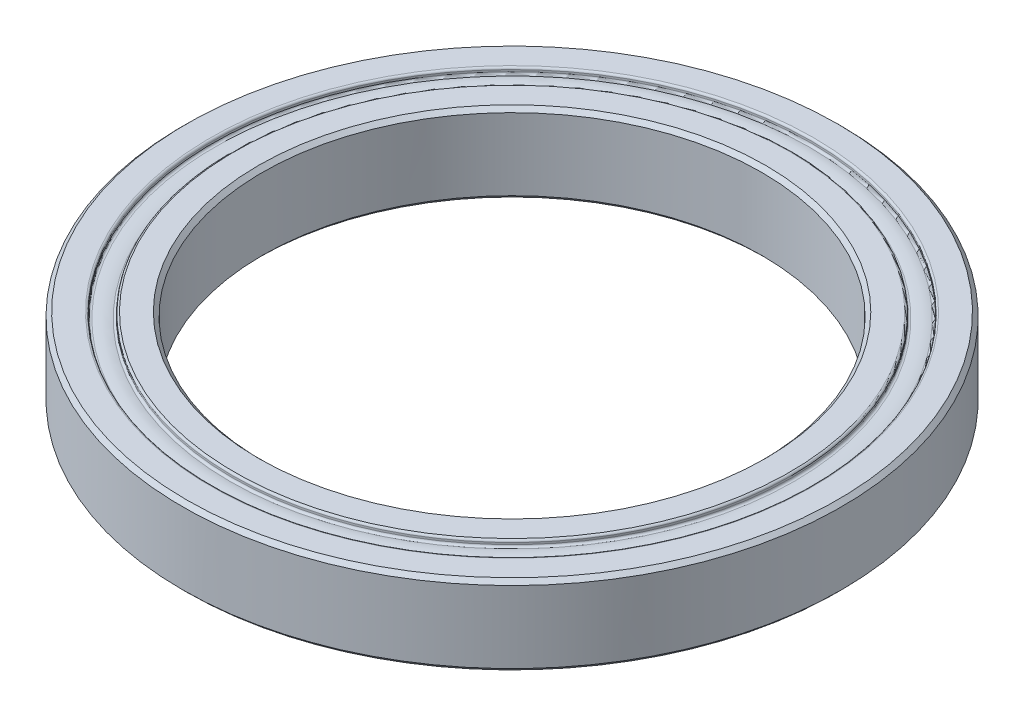
ISO-10303-21;
HEADER;
FILE_DESCRIPTION(('STEP AP214'),'2;1');
FILE_NAME('part.step','',(''),(''),'','','');
FILE_SCHEMA(('AUTOMOTIVE_DESIGN { 1 0 10303 214 1 1 1 1 }'));
ENDSEC;
DATA;
#1=APPLICATION_CONTEXT('core data for automotive mechanical design processes');
#2=APPLICATION_PROTOCOL_DEFINITION('international standard','automotive_design',2000,#1);
#3=PRODUCT_CONTEXT('',#1,'mechanical');
#4=PRODUCT('Part','Part','',(#3));
#5=PRODUCT_RELATED_PRODUCT_CATEGORY('part','',(#4));
#6=PRODUCT_DEFINITION_FORMATION('','',#4);
#7=PRODUCT_DEFINITION_CONTEXT('part definition',#1,'design');
#8=PRODUCT_DEFINITION('design','',#6,#7);
#9=PRODUCT_DEFINITION_SHAPE('','',#8);
#10=(LENGTH_UNIT() NAMED_UNIT(*) SI_UNIT(.MILLI.,.METRE.));
#11=(NAMED_UNIT(*) PLANE_ANGLE_UNIT() SI_UNIT($,.RADIAN.));
#12=(NAMED_UNIT(*) SI_UNIT($,.STERADIAN.) SOLID_ANGLE_UNIT());
#13=UNCERTAINTY_MEASURE_WITH_UNIT(LENGTH_MEASURE(1.E-05),#10,'distance_accuracy_value','');
#14=(GEOMETRIC_REPRESENTATION_CONTEXT(3) GLOBAL_UNCERTAINTY_ASSIGNED_CONTEXT((#13)) GLOBAL_UNIT_ASSIGNED_CONTEXT((#10,
#11,#12)) REPRESENTATION_CONTEXT('',''));
#15=CARTESIAN_POINT('',(0.,0.,0.));
#16=DIRECTION('',(0.,0.,1.));
#17=DIRECTION('',(1.,0.,0.));
#18=AXIS2_PLACEMENT_3D('',#15,#16,#17);
#19=CARTESIAN_POINT('',(-27.8,8.,0.));
#20=DIRECTION('',(0.,-1.,0.));
#21=DIRECTION('',(0.,0.,-1.));
#22=AXIS2_PLACEMENT_3D('',#19,#20,#21);
#23=PLANE('',#22);
#24=CARTESIAN_POINT('',(0.,8.,0.));
#25=DIRECTION('',(0.,-1.,0.));
#26=DIRECTION('',(0.,0.,-1.));
#27=AXIS2_PLACEMENT_3D('',#24,#25,#26);
#28=CIRCLE('',#27,25.4);
#29=CARTESIAN_POINT('',(0.,8.,-25.4));
#30=VERTEX_POINT('',#29);
#31=EDGE_CURVE('E52',#30,#30,#28,.T.);
#32=ORIENTED_EDGE('',*,*,#31,.T.);
#33=EDGE_LOOP('',(#32));
#34=FACE_BOUND('',#33,.T.);
#35=CARTESIAN_POINT('',(0.,8.00000000000001,0.));
#36=DIRECTION('',(0.,-1.,0.));
#37=DIRECTION('',(0.,0.,-1.));
#38=AXIS2_PLACEMENT_3D('',#35,#36,#37);
#39=CIRCLE('',#38,27.8);
#40=CARTESIAN_POINT('',(0.,8.00000000000001,-27.8));
#41=VERTEX_POINT('',#40);
#42=EDGE_CURVE('E109',#41,#41,#39,.T.);
#43=ORIENTED_EDGE('',*,*,#42,.F.);
#44=EDGE_LOOP('',(#43));
#45=FACE_BOUND('',#44,.T.);
#46=ADVANCED_FACE('F32',(#34,#45),#23,.F.);
#47=CARTESIAN_POINT('',(0.,0.,0.));
#48=DIRECTION('',(0.,-1.,0.));
#49=DIRECTION('',(0.,0.,-1.));
#50=AXIS2_PLACEMENT_3D('',#47,#48,#49);
#51=CYLINDRICAL_SURFACE('',#50,25.);
#52=CARTESIAN_POINT('',(0.,7.60000000000001,0.));
#53=DIRECTION('',(0.,-1.,0.));
#54=DIRECTION('',(0.,0.,-1.));
#55=AXIS2_PLACEMENT_3D('',#52,#53,#54);
#56=CIRCLE('',#55,25.);
#57=CARTESIAN_POINT('',(0.,7.60000000000001,-25.));
#58=VERTEX_POINT('',#57);
#59=EDGE_CURVE('E43',#58,#58,#56,.F.);
#60=ORIENTED_EDGE('',*,*,#59,.T.);
#61=EDGE_LOOP('',(#60));
#62=FACE_BOUND('',#61,.T.);
#63=CARTESIAN_POINT('',(0.,0.399999999999978,0.));
#64=DIRECTION('',(0.,1.,0.));
#65=DIRECTION('',(0.,0.,1.));
#66=AXIS2_PLACEMENT_3D('',#63,#64,#65);
#67=CIRCLE('',#66,25.);
#68=CARTESIAN_POINT('',(0.,0.399999999999978,25.));
#69=VERTEX_POINT('',#68);
#70=EDGE_CURVE('E47',#69,#69,#67,.F.);
#71=ORIENTED_EDGE('',*,*,#70,.T.);
#72=EDGE_LOOP('',(#71));
#73=FACE_BOUND('',#72,.T.);
#74=ADVANCED_FACE('F116',(#62,#73),#51,.F.);
#75=CARTESIAN_POINT('',(-25.,0.,0.));
#76=DIRECTION('',(0.,1.,0.));
#77=DIRECTION('',(0.,0.,1.));
#78=AXIS2_PLACEMENT_3D('',#75,#76,#77);
#79=PLANE('',#78);
#80=CARTESIAN_POINT('',(0.,0.,0.));
#81=DIRECTION('',(0.,1.,0.));
#82=DIRECTION('',(0.,0.,1.));
#83=AXIS2_PLACEMENT_3D('',#80,#81,#82);
#84=CIRCLE('',#83,25.4);
#85=CARTESIAN_POINT('',(0.,0.,25.4));
#86=VERTEX_POINT('',#85);
#87=EDGE_CURVE('E39',#86,#86,#84,.T.);
#88=ORIENTED_EDGE('',*,*,#87,.T.);
#89=EDGE_LOOP('',(#88));
#90=FACE_BOUND('',#89,.T.);
#91=CARTESIAN_POINT('',(0.,0.,0.));
#92=DIRECTION('',(0.,-1.,0.));
#93=DIRECTION('',(0.,0.,-1.));
#94=AXIS2_PLACEMENT_3D('',#91,#92,#93);
#95=CIRCLE('',#94,27.8);
#96=CARTESIAN_POINT('',(0.,0.,-27.8));
#97=VERTEX_POINT('',#96);
#98=EDGE_CURVE('E64',#97,#97,#95,.T.);
#99=ORIENTED_EDGE('',*,*,#98,.T.);
#100=EDGE_LOOP('',(#99));
#101=FACE_BOUND('',#100,.T.);
#102=ADVANCED_FACE('F122',(#90,#101),#79,.F.);
#103=CARTESIAN_POINT('',(0.,0.2,0.));
#104=DIRECTION('',(0.,-1.,0.));
#105=DIRECTION('',(0.,0.,-1.));
#106=AXIS2_PLACEMENT_3D('',#103,#104,#105);
#107=TOROIDAL_SURFACE('',#106,27.8,0.2);
#108=ORIENTED_EDGE('',*,*,#98,.F.);
#109=EDGE_LOOP('',(#108));
#110=FACE_BOUND('',#109,.T.);
#111=CARTESIAN_POINT('',(0.,0.2,0.));
#112=DIRECTION('',(0.,-1.,0.));
#113=DIRECTION('',(0.,0.,-1.));
#114=AXIS2_PLACEMENT_3D('',#111,#112,#113);
#115=CIRCLE('',#114,28.);
#116=CARTESIAN_POINT('',(0.,0.2,-28.));
#117=VERTEX_POINT('',#116);
#118=EDGE_CURVE('E67',#117,#117,#115,.T.);
#119=ORIENTED_EDGE('',*,*,#118,.T.);
#120=EDGE_LOOP('',(#119));
#121=FACE_BOUND('',#120,.T.);
#122=ADVANCED_FACE('F188',(#110,#121),#107,.T.);
#123=CARTESIAN_POINT('',(0.,0.,0.));
#124=DIRECTION('',(0.,-1.,0.));
#125=DIRECTION('',(0.,0.,-1.));
#126=AXIS2_PLACEMENT_3D('',#123,#124,#125);
#127=CYLINDRICAL_SURFACE('',#126,28.);
#128=ORIENTED_EDGE('',*,*,#118,.F.);
#129=EDGE_LOOP('',(#128));
#130=FACE_BOUND('',#129,.T.);
#131=CARTESIAN_POINT('',(0.,0.387521626362308,0.));
#132=DIRECTION('',(0.,-1.,0.));
#133=DIRECTION('',(0.,0.,-1.));
#134=AXIS2_PLACEMENT_3D('',#131,#132,#133);
#135=CIRCLE('',#134,28.);
#136=CARTESIAN_POINT('',(0.,0.387521626362308,-28.));
#137=VERTEX_POINT('',#136);
#138=EDGE_CURVE('E70',#137,#137,#135,.T.);
#139=ORIENTED_EDGE('',*,*,#138,.T.);
#140=EDGE_LOOP('',(#139));
#141=FACE_BOUND('',#140,.T.);
#142=ADVANCED_FACE('F184',(#130,#141),#127,.T.);
#143=CARTESIAN_POINT('',(0.,0.387521626362308,0.));
#144=DIRECTION('',(0.,-1.,0.));
#145=DIRECTION('',(0.,0.,-1.));
#146=AXIS2_PLACEMENT_3D('',#143,#144,#145);
#147=TOROIDAL_SURFACE('',#146,28.2,0.200000000000001);
#148=ORIENTED_EDGE('',*,*,#138,.F.);
#149=EDGE_LOOP('',(#148));
#150=FACE_BOUND('',#149,.T.);
#151=CARTESIAN_POINT('',(0.,0.582790727640021,0.));
#152=DIRECTION('',(0.,-1.,0.));
#153=DIRECTION('',(0.,0.,-1.));
#154=AXIS2_PLACEMENT_3D('',#151,#152,#153);
#155=CIRCLE('',#154,28.2432432432433);
#156=CARTESIAN_POINT('',(0.,0.582790727640021,-28.2432432432433));
#157=VERTEX_POINT('',#156);
#158=EDGE_CURVE('E73',#157,#157,#155,.T.);
#159=ORIENTED_EDGE('',*,*,#158,.T.);
#160=EDGE_LOOP('',(#159));
#161=FACE_BOUND('',#160,.T.);
#162=ADVANCED_FACE('F180',(#150,#161),#147,.F.);
#163=CARTESIAN_POINT('',(0.,4.,0.));
#164=DIRECTION('',(0.,-1.,0.));
#165=DIRECTION('',(0.,0.,-1.));
#166=AXIS2_PLACEMENT_3D('',#163,#164,#165);
#167=TOROIDAL_SURFACE('',#166,29.,3.5);
#168=ORIENTED_EDGE('',*,*,#158,.F.);
#169=EDGE_LOOP('',(#168));
#170=FACE_BOUND('',#169,.T.);
#171=CARTESIAN_POINT('',(0.,0.582790727640023,0.));
#172=DIRECTION('',(0.,-1.,0.));
#173=DIRECTION('',(0.,0.,-1.));
#174=AXIS2_PLACEMENT_3D('',#171,#172,#173);
#175=CIRCLE('',#174,29.7567567567568);
#176=CARTESIAN_POINT('',(0.,0.582790727640023,-29.7567567567568));
#177=VERTEX_POINT('',#176);
#178=EDGE_CURVE('E76',#177,#177,#175,.T.);
#179=ORIENTED_EDGE('',*,*,#178,.T.);
#180=EDGE_LOOP('',(#179));
#181=FACE_BOUND('',#180,.T.);
#182=ADVANCED_FACE('F176',(#170,#181),#167,.T.);
#183=CARTESIAN_POINT('',(0.,0.387521626362311,0.));
#184=DIRECTION('',(0.,-1.,0.));
#185=DIRECTION('',(0.,0.,-1.));
#186=AXIS2_PLACEMENT_3D('',#183,#184,#185);
#187=TOROIDAL_SURFACE('',#186,29.8,0.199999999999996);
#188=ORIENTED_EDGE('',*,*,#178,.F.);
#189=EDGE_LOOP('',(#188));
#190=FACE_BOUND('',#189,.T.);
#191=CARTESIAN_POINT('',(0.,0.387521626362311,0.));
#192=DIRECTION('',(0.,-1.,0.));
#193=DIRECTION('',(0.,0.,-1.));
#194=AXIS2_PLACEMENT_3D('',#191,#192,#193);
#195=CIRCLE('',#194,30.);
#196=CARTESIAN_POINT('',(0.,0.387521626362311,-30.));
#197=VERTEX_POINT('',#196);
#198=EDGE_CURVE('E79',#197,#197,#195,.T.);
#199=ORIENTED_EDGE('',*,*,#198,.T.);
#200=EDGE_LOOP('',(#199));
#201=FACE_BOUND('',#200,.T.);
#202=ADVANCED_FACE('F172',(#190,#201),#187,.F.);
#203=CARTESIAN_POINT('',(0.,0.,0.));
#204=DIRECTION('',(0.,-1.,0.));
#205=DIRECTION('',(0.,0.,-1.));
#206=AXIS2_PLACEMENT_3D('',#203,#204,#205);
#207=CYLINDRICAL_SURFACE('',#206,30.);
#208=ORIENTED_EDGE('',*,*,#198,.F.);
#209=EDGE_LOOP('',(#208));
#210=FACE_BOUND('',#209,.T.);
#211=CARTESIAN_POINT('',(0.,0.199999999999999,0.));
#212=DIRECTION('',(0.,-1.,0.));
#213=DIRECTION('',(0.,0.,-1.));
#214=AXIS2_PLACEMENT_3D('',#211,#212,#213);
#215=CIRCLE('',#214,30.);
#216=CARTESIAN_POINT('',(0.,0.199999999999999,-30.));
#217=VERTEX_POINT('',#216);
#218=EDGE_CURVE('E82',#217,#217,#215,.T.);
#219=ORIENTED_EDGE('',*,*,#218,.T.);
#220=EDGE_LOOP('',(#219));
#221=FACE_BOUND('',#220,.T.);
#222=ADVANCED_FACE('F168',(#210,#221),#207,.F.);
#223=CARTESIAN_POINT('',(0.,0.199999999999999,0.));
#224=DIRECTION('',(0.,-1.,0.));
#225=DIRECTION('',(0.,0.,-1.));
#226=AXIS2_PLACEMENT_3D('',#223,#224,#225);
#227=TOROIDAL_SURFACE('',#226,30.2,0.2);
#228=ORIENTED_EDGE('',*,*,#218,.F.);
#229=EDGE_LOOP('',(#228));
#230=FACE_BOUND('',#229,.T.);
#231=CARTESIAN_POINT('',(0.,0.,0.));
#232=DIRECTION('',(0.,-1.,0.));
#233=DIRECTION('',(0.,0.,-1.));
#234=AXIS2_PLACEMENT_3D('',#231,#232,#233);
#235=CIRCLE('',#234,30.2);
#236=CARTESIAN_POINT('',(0.,0.,-30.2));
#237=VERTEX_POINT('',#236);
#238=EDGE_CURVE('E85',#237,#237,#235,.T.);
#239=ORIENTED_EDGE('',*,*,#238,.T.);
#240=EDGE_LOOP('',(#239));
#241=FACE_BOUND('',#240,.T.);
#242=ADVANCED_FACE('F162',(#230,#241),#227,.T.);
#243=CARTESIAN_POINT('',(-30.2,0.,0.));
#244=DIRECTION('',(0.,1.,0.));
#245=DIRECTION('',(0.,0.,1.));
#246=AXIS2_PLACEMENT_3D('',#243,#244,#245);
#247=PLANE('',#246);
#248=CARTESIAN_POINT('',(0.,0.,0.));
#249=DIRECTION('',(0.,1.,0.));
#250=DIRECTION('',(0.,0.,1.));
#251=AXIS2_PLACEMENT_3D('',#248,#249,#250);
#252=CIRCLE('',#251,32.6);
#253=CARTESIAN_POINT('',(0.,0.,32.6));
#254=VERTEX_POINT('',#253);
#255=EDGE_CURVE('E10',#254,#254,#252,.F.);
#256=ORIENTED_EDGE('',*,*,#255,.T.);
#257=EDGE_LOOP('',(#256));
#258=FACE_BOUND('',#257,.T.);
#259=ORIENTED_EDGE('',*,*,#238,.F.);
#260=EDGE_LOOP('',(#259));
#261=FACE_BOUND('',#260,.T.);
#262=ADVANCED_FACE('F152',(#258,#261),#247,.F.);
#263=CARTESIAN_POINT('',(0.,0.,0.));
#264=DIRECTION('',(0.,-1.,0.));
#265=DIRECTION('',(0.,0.,-1.));
#266=AXIS2_PLACEMENT_3D('',#263,#264,#265);
#267=CYLINDRICAL_SURFACE('',#266,33.);
#268=CARTESIAN_POINT('',(0.,7.60000000000001,0.));
#269=DIRECTION('',(0.,-1.,0.));
#270=DIRECTION('',(0.,0.,-1.));
#271=AXIS2_PLACEMENT_3D('',#268,#269,#270);
#272=CIRCLE('',#271,33.);
#273=CARTESIAN_POINT('',(0.,7.60000000000001,-33.));
#274=VERTEX_POINT('',#273);
#275=EDGE_CURVE('E58',#274,#274,#272,.T.);
#276=ORIENTED_EDGE('',*,*,#275,.T.);
#277=EDGE_LOOP('',(#276));
#278=FACE_BOUND('',#277,.T.);
#279=CARTESIAN_POINT('',(0.,0.400000000000015,0.));
#280=DIRECTION('',(0.,1.,0.));
#281=DIRECTION('',(0.,0.,1.));
#282=AXIS2_PLACEMENT_3D('',#279,#280,#281);
#283=CIRCLE('',#282,33.);
#284=CARTESIAN_POINT('',(0.,0.400000000000015,33.));
#285=VERTEX_POINT('',#284);
#286=EDGE_CURVE('E61',#285,#285,#283,.T.);
#287=ORIENTED_EDGE('',*,*,#286,.T.);
#288=EDGE_LOOP('',(#287));
#289=FACE_BOUND('',#288,.T.);
#290=ADVANCED_FACE('F149',(#278,#289),#267,.T.);
#291=CARTESIAN_POINT('',(-33.,8.00000000000001,0.));
#292=DIRECTION('',(0.,-1.,0.));
#293=DIRECTION('',(0.,0.,-1.));
#294=AXIS2_PLACEMENT_3D('',#291,#292,#293);
#295=PLANE('',#294);
#296=CARTESIAN_POINT('',(0.,8.00000000000001,0.));
#297=DIRECTION('',(0.,-1.,0.));
#298=DIRECTION('',(0.,0.,-1.));
#299=AXIS2_PLACEMENT_3D('',#296,#297,#298);
#300=CIRCLE('',#299,32.6);
#301=CARTESIAN_POINT('',(0.,8.00000000000001,-32.6));
#302=VERTEX_POINT('',#301);
#303=EDGE_CURVE('E55',#302,#302,#300,.F.);
#304=ORIENTED_EDGE('',*,*,#303,.T.);
#305=EDGE_LOOP('',(#304));
#306=FACE_BOUND('',#305,.T.);
#307=CARTESIAN_POINT('',(0.,8.00000000000001,0.));
#308=DIRECTION('',(0.,-1.,0.));
#309=DIRECTION('',(0.,0.,-1.));
#310=AXIS2_PLACEMENT_3D('',#307,#308,#309);
#311=CIRCLE('',#310,30.2);
#312=CARTESIAN_POINT('',(0.,8.00000000000001,-30.2));
#313=VERTEX_POINT('',#312);
#314=EDGE_CURVE('E88',#313,#313,#311,.T.);
#315=ORIENTED_EDGE('',*,*,#314,.T.);
#316=EDGE_LOOP('',(#315));
#317=FACE_BOUND('',#316,.T.);
#318=ADVANCED_FACE('F151',(#306,#317),#295,.F.);
#319=CARTESIAN_POINT('',(0.,7.80000000000001,0.));
#320=DIRECTION('',(0.,-1.,0.));
#321=DIRECTION('',(0.,0.,-1.));
#322=AXIS2_PLACEMENT_3D('',#319,#320,#321);
#323=TOROIDAL_SURFACE('',#322,30.2,0.2);
#324=ORIENTED_EDGE('',*,*,#314,.F.);
#325=EDGE_LOOP('',(#324));
#326=FACE_BOUND('',#325,.T.);
#327=CARTESIAN_POINT('',(0.,7.80000000000001,0.));
#328=DIRECTION('',(0.,-1.,0.));
#329=DIRECTION('',(0.,0.,-1.));
#330=AXIS2_PLACEMENT_3D('',#327,#328,#329);
#331=CIRCLE('',#330,30.);
#332=CARTESIAN_POINT('',(0.,7.80000000000001,-30.));
#333=VERTEX_POINT('',#332);
#334=EDGE_CURVE('E91',#333,#333,#331,.T.);
#335=ORIENTED_EDGE('',*,*,#334,.T.);
#336=EDGE_LOOP('',(#335));
#337=FACE_BOUND('',#336,.T.);
#338=ADVANCED_FACE('F159',(#326,#337),#323,.T.);
#339=CARTESIAN_POINT('',(0.,0.,0.));
#340=DIRECTION('',(0.,-1.,0.));
#341=DIRECTION('',(0.,0.,-1.));
#342=AXIS2_PLACEMENT_3D('',#339,#340,#341);
#343=CYLINDRICAL_SURFACE('',#342,30.);
#344=ORIENTED_EDGE('',*,*,#334,.F.);
#345=EDGE_LOOP('',(#344));
#346=FACE_BOUND('',#345,.T.);
#347=CARTESIAN_POINT('',(0.,7.61247837363769,0.));
#348=DIRECTION('',(0.,-1.,0.));
#349=DIRECTION('',(0.,0.,-1.));
#350=AXIS2_PLACEMENT_3D('',#347,#348,#349);
#351=CIRCLE('',#350,30.);
#352=CARTESIAN_POINT('',(0.,7.61247837363769,-30.));
#353=VERTEX_POINT('',#352);
#354=EDGE_CURVE('E94',#353,#353,#351,.T.);
#355=ORIENTED_EDGE('',*,*,#354,.T.);
#356=EDGE_LOOP('',(#355));
#357=FACE_BOUND('',#356,.T.);
#358=ADVANCED_FACE('F319',(#346,#357),#343,.F.);
#359=CARTESIAN_POINT('',(0.,7.61247837363769,0.));
#360=DIRECTION('',(0.,-1.,0.));
#361=DIRECTION('',(0.,0.,-1.));
#362=AXIS2_PLACEMENT_3D('',#359,#360,#361);
#363=TOROIDAL_SURFACE('',#362,29.8,0.2);
#364=ORIENTED_EDGE('',*,*,#354,.F.);
#365=EDGE_LOOP('',(#364));
#366=FACE_BOUND('',#365,.T.);
#367=CARTESIAN_POINT('',(0.,7.41720927235997,0.));
#368=DIRECTION('',(0.,-1.,0.));
#369=DIRECTION('',(0.,0.,-1.));
#370=AXIS2_PLACEMENT_3D('',#367,#368,#369);
#371=CIRCLE('',#370,29.7567567567568);
#372=CARTESIAN_POINT('',(0.,7.41720927235997,-29.7567567567568));
#373=VERTEX_POINT('',#372);
#374=EDGE_CURVE('E97',#373,#373,#371,.T.);
#375=ORIENTED_EDGE('',*,*,#374,.T.);
#376=EDGE_LOOP('',(#375));
#377=FACE_BOUND('',#376,.T.);
#378=ADVANCED_FACE('F311',(#366,#377),#363,.F.);
#379=CARTESIAN_POINT('',(0.,4.,0.));
#380=DIRECTION('',(0.,-1.,0.));
#381=DIRECTION('',(0.,0.,-1.));
#382=AXIS2_PLACEMENT_3D('',#379,#380,#381);
#383=TOROIDAL_SURFACE('',#382,29.,3.5);
#384=ORIENTED_EDGE('',*,*,#374,.F.);
#385=EDGE_LOOP('',(#384));
#386=FACE_BOUND('',#385,.T.);
#387=CARTESIAN_POINT('',(0.,7.41720927235998,0.));
#388=DIRECTION('',(0.,-1.,0.));
#389=DIRECTION('',(0.,0.,-1.));
#390=AXIS2_PLACEMENT_3D('',#387,#388,#389);
#391=CIRCLE('',#390,28.2432432432432);
#392=CARTESIAN_POINT('',(0.,7.41720927235998,-28.2432432432432));
#393=VERTEX_POINT('',#392);
#394=EDGE_CURVE('E100',#393,#393,#391,.T.);
#395=ORIENTED_EDGE('',*,*,#394,.T.);
#396=EDGE_LOOP('',(#395));
#397=FACE_BOUND('',#396,.T.);
#398=ADVANCED_FACE('F303',(#386,#397),#383,.T.);
#399=CARTESIAN_POINT('',(0.,7.61247837363769,0.));
#400=DIRECTION('',(0.,-1.,0.));
#401=DIRECTION('',(0.,0.,-1.));
#402=AXIS2_PLACEMENT_3D('',#399,#400,#401);
#403=TOROIDAL_SURFACE('',#402,28.2,0.199999999999999);
#404=ORIENTED_EDGE('',*,*,#394,.F.);
#405=EDGE_LOOP('',(#404));
#406=FACE_BOUND('',#405,.T.);
#407=CARTESIAN_POINT('',(0.,7.61247837363769,0.));
#408=DIRECTION('',(0.,-1.,0.));
#409=DIRECTION('',(0.,0.,-1.));
#410=AXIS2_PLACEMENT_3D('',#407,#408,#409);
#411=CIRCLE('',#410,28.);
#412=CARTESIAN_POINT('',(0.,7.61247837363769,-28.));
#413=VERTEX_POINT('',#412);
#414=EDGE_CURVE('E103',#413,#413,#411,.T.);
#415=ORIENTED_EDGE('',*,*,#414,.T.);
#416=EDGE_LOOP('',(#415));
#417=FACE_BOUND('',#416,.T.);
#418=ADVANCED_FACE('F295',(#406,#417),#403,.F.);
#419=CARTESIAN_POINT('',(0.,0.,0.));
#420=DIRECTION('',(0.,-1.,0.));
#421=DIRECTION('',(0.,0.,-1.));
#422=AXIS2_PLACEMENT_3D('',#419,#420,#421);
#423=CYLINDRICAL_SURFACE('',#422,28.);
#424=ORIENTED_EDGE('',*,*,#414,.F.);
#425=EDGE_LOOP('',(#424));
#426=FACE_BOUND('',#425,.T.);
#427=CARTESIAN_POINT('',(0.,7.80000000000001,0.));
#428=DIRECTION('',(0.,-1.,0.));
#429=DIRECTION('',(0.,0.,-1.));
#430=AXIS2_PLACEMENT_3D('',#427,#428,#429);
#431=CIRCLE('',#430,28.);
#432=CARTESIAN_POINT('',(0.,7.80000000000001,-28.));
#433=VERTEX_POINT('',#432);
#434=EDGE_CURVE('E106',#433,#433,#431,.T.);
#435=ORIENTED_EDGE('',*,*,#434,.T.);
#436=EDGE_LOOP('',(#435));
#437=FACE_BOUND('',#436,.T.);
#438=ADVANCED_FACE('F288',(#426,#437),#423,.T.);
#439=CARTESIAN_POINT('',(0.,7.80000000000001,0.));
#440=DIRECTION('',(0.,-1.,0.));
#441=DIRECTION('',(0.,0.,-1.));
#442=AXIS2_PLACEMENT_3D('',#439,#440,#441);
#443=TOROIDAL_SURFACE('',#442,27.8,0.2);
#444=ORIENTED_EDGE('',*,*,#434,.F.);
#445=EDGE_LOOP('',(#444));
#446=FACE_BOUND('',#445,.T.);
#447=ORIENTED_EDGE('',*,*,#42,.T.);
#448=EDGE_LOOP('',(#447));
#449=FACE_BOUND('',#448,.T.);
#450=ADVANCED_FACE('F113',(#446,#449),#443,.T.);
#451=CARTESIAN_POINT('',(0.,7.60000000000001,0.));
#452=DIRECTION('',(0.,-1.,0.));
#453=DIRECTION('',(0.,0.,-1.));
#454=AXIS2_PLACEMENT_3D('',#451,#452,#453);
#455=CONICAL_SURFACE('',#454,33.,0.785398163397457);
#456=ORIENTED_EDGE('',*,*,#303,.F.);
#457=EDGE_LOOP('',(#456));
#458=FACE_BOUND('',#457,.T.);
#459=ORIENTED_EDGE('',*,*,#275,.F.);
#460=EDGE_LOOP('',(#459));
#461=FACE_BOUND('',#460,.T.);
#462=ADVANCED_FACE('F127',(#458,#461),#455,.T.);
#463=CARTESIAN_POINT('',(0.,8.,0.));
#464=DIRECTION('',(0.,1.,0.));
#465=DIRECTION('',(0.,0.,1.));
#466=AXIS2_PLACEMENT_3D('',#463,#464,#465);
#467=CONICAL_SURFACE('',#466,25.4,0.785398163397453);
#468=ORIENTED_EDGE('',*,*,#59,.F.);
#469=EDGE_LOOP('',(#468));
#470=FACE_BOUND('',#469,.T.);
#471=ORIENTED_EDGE('',*,*,#31,.F.);
#472=EDGE_LOOP('',(#471));
#473=FACE_BOUND('',#472,.T.);
#474=ADVANCED_FACE('F130',(#470,#473),#467,.F.);
#475=CARTESIAN_POINT('',(0.,0.399999999999978,0.));
#476=DIRECTION('',(0.,-1.,0.));
#477=DIRECTION('',(0.,0.,-1.));
#478=AXIS2_PLACEMENT_3D('',#475,#476,#477);
#479=CONICAL_SURFACE('',#478,25.,0.785398163397461);
#480=ORIENTED_EDGE('',*,*,#87,.F.);
#481=EDGE_LOOP('',(#480));
#482=FACE_BOUND('',#481,.T.);
#483=ORIENTED_EDGE('',*,*,#70,.F.);
#484=EDGE_LOOP('',(#483));
#485=FACE_BOUND('',#484,.T.);
#486=ADVANCED_FACE('F133',(#482,#485),#479,.F.);
#487=CARTESIAN_POINT('',(0.,0.,0.));
#488=DIRECTION('',(0.,1.,0.));
#489=DIRECTION('',(0.,0.,1.));
#490=AXIS2_PLACEMENT_3D('',#487,#488,#489);
#491=CONICAL_SURFACE('',#490,32.6,0.785398163397448);
#492=ORIENTED_EDGE('',*,*,#286,.F.);
#493=EDGE_LOOP('',(#492));
#494=FACE_BOUND('',#493,.T.);
#495=ORIENTED_EDGE('',*,*,#255,.F.);
#496=EDGE_LOOP('',(#495));
#497=FACE_BOUND('',#496,.T.);
#498=ADVANCED_FACE('F34',(#494,#497),#491,.T.);
#499=CLOSED_SHELL('',(#46,#74,#102,#122,#142,#162,#182,#202,#222,#242,#262,#290,#318,#338,#358,
#378,#398,#418,#438,#450,#462,#474,#486,#498));
#500=MANIFOLD_SOLID_BREP('B2',#499);
#501=ADVANCED_BREP_SHAPE_REPRESENTATION('',(#18,#500),#14);
#502=SHAPE_DEFINITION_REPRESENTATION(#9,#501);
ENDSEC;
END-ISO-10303-21;
